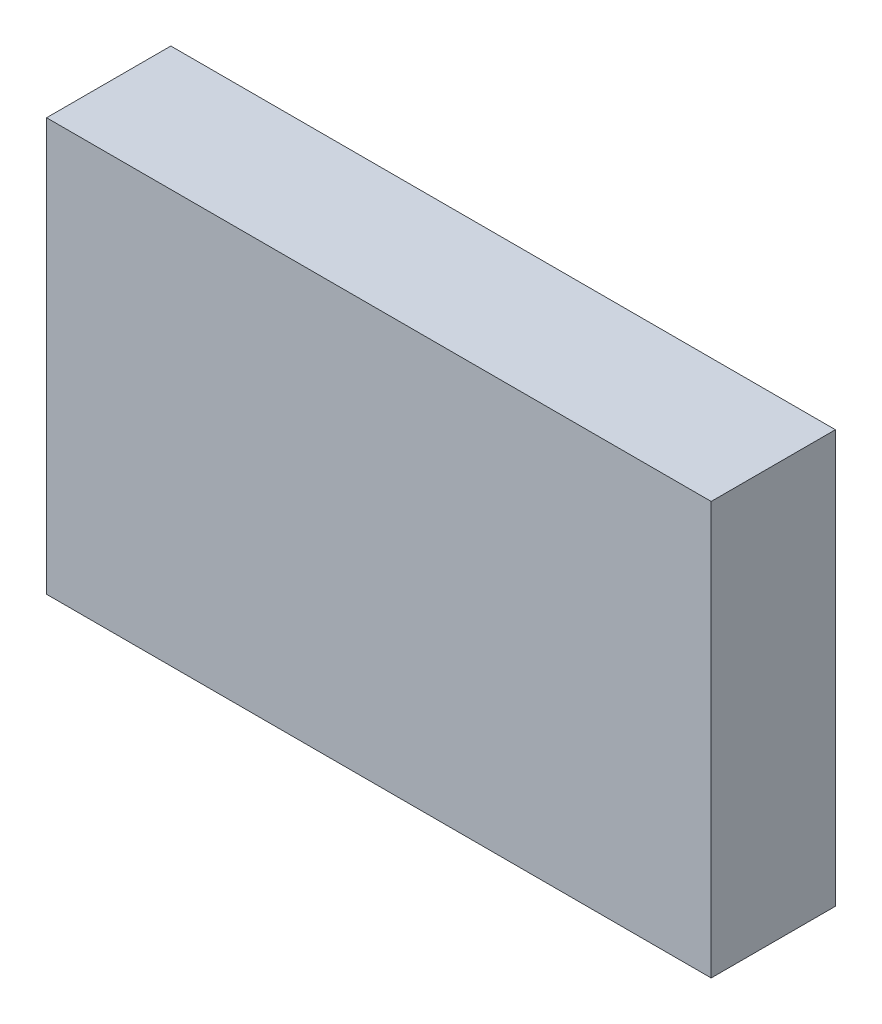
ISO-10303-21;
HEADER;
FILE_DESCRIPTION(('STEP AP214'),'2;1');
FILE_NAME('part.step','',(''),(''),'','','');
FILE_SCHEMA(('AUTOMOTIVE_DESIGN { 1 0 10303 214 1 1 1 1 }'));
ENDSEC;
DATA;
#1=APPLICATION_CONTEXT('core data for automotive mechanical design processes');
#2=APPLICATION_PROTOCOL_DEFINITION('international standard','automotive_design',2000,#1);
#3=PRODUCT_CONTEXT('',#1,'mechanical');
#4=PRODUCT('Part','Part','',(#3));
#5=PRODUCT_RELATED_PRODUCT_CATEGORY('part','',(#4));
#6=PRODUCT_DEFINITION_FORMATION('','',#4);
#7=PRODUCT_DEFINITION_CONTEXT('part definition',#1,'design');
#8=PRODUCT_DEFINITION('design','',#6,#7);
#9=PRODUCT_DEFINITION_SHAPE('','',#8);
#10=(LENGTH_UNIT() NAMED_UNIT(*) SI_UNIT(.MILLI.,.METRE.));
#11=(NAMED_UNIT(*) PLANE_ANGLE_UNIT() SI_UNIT($,.RADIAN.));
#12=(NAMED_UNIT(*) SI_UNIT($,.STERADIAN.) SOLID_ANGLE_UNIT());
#13=UNCERTAINTY_MEASURE_WITH_UNIT(LENGTH_MEASURE(1.E-05),#10,'distance_accuracy_value','');
#14=(GEOMETRIC_REPRESENTATION_CONTEXT(3) GLOBAL_UNCERTAINTY_ASSIGNED_CONTEXT((#13)) GLOBAL_UNIT_ASSIGNED_CONTEXT((#10,
#11,#12)) REPRESENTATION_CONTEXT('',''));
#15=CARTESIAN_POINT('',(0.,0.,0.));
#16=DIRECTION('',(0.,0.,1.));
#17=DIRECTION('',(1.,0.,0.));
#18=AXIS2_PLACEMENT_3D('',#15,#16,#17);
#19=CARTESIAN_POINT('',(0.,0.,0.));
#20=DIRECTION('',(-1.,0.,0.));
#21=DIRECTION('',(0.,0.,1.));
#22=AXIS2_PLACEMENT_3D('',#19,#20,#21);
#23=PLANE('',#22);
#24=DIRECTION('',(0.,0.,-1.));
#25=VECTOR('',#24,1.);
#26=CARTESIAN_POINT('',(0.,1489.71317371385,-186.935060191615));
#27=LINE('',#26,#25);
#28=CARTESIAN_POINT('',(0.,1489.71317371385,0.));
#29=VERTEX_POINT('',#28);
#30=CARTESIAN_POINT('',(0.,1489.71317371385,-186.935060191615));
#31=VERTEX_POINT('',#30);
#32=EDGE_CURVE('E77',#29,#31,#27,.T.);
#33=ORIENTED_EDGE('',*,*,#32,.F.);
#34=DIRECTION('',(0.,-1.,0.));
#35=VECTOR('',#34,1.);
#36=CARTESIAN_POINT('',(0.,1489.71317371385,0.));
#37=LINE('',#36,#35);
#38=CARTESIAN_POINT('',(0.,2110.71127200825,0.));
#39=VERTEX_POINT('',#38);
#40=EDGE_CURVE('E81',#39,#29,#37,.T.);
#41=ORIENTED_EDGE('',*,*,#40,.F.);
#42=DIRECTION('',(0.,0.,1.));
#43=VECTOR('',#42,1.);
#44=CARTESIAN_POINT('',(0.,2110.71127200825,0.));
#45=LINE('',#44,#43);
#46=CARTESIAN_POINT('',(0.,2110.71127200825,-186.935060191615));
#47=VERTEX_POINT('',#46);
#48=EDGE_CURVE('E84',#47,#39,#45,.T.);
#49=ORIENTED_EDGE('',*,*,#48,.F.);
#50=DIRECTION('',(0.,1.,0.));
#51=VECTOR('',#50,1.);
#52=CARTESIAN_POINT('',(0.,2110.71127200825,-186.935060191615));
#53=LINE('',#52,#51);
#54=EDGE_CURVE('E72',#31,#47,#53,.T.);
#55=ORIENTED_EDGE('',*,*,#54,.F.);
#56=EDGE_LOOP('',(#33,#41,#49,#55));
#57=FACE_BOUND('',#56,.T.);
#58=ADVANCED_FACE('F42',(#57),#23,.T.);
#59=CARTESIAN_POINT('',(1000.,0.,0.));
#60=DIRECTION('',(-1.,0.,0.));
#61=DIRECTION('',(0.,0.,1.));
#62=AXIS2_PLACEMENT_3D('',#59,#60,#61);
#63=PLANE('',#62);
#64=DIRECTION('',(0.,0.,-1.));
#65=VECTOR('',#64,1.);
#66=CARTESIAN_POINT('',(1000.,1489.71317371385,-186.935060191615));
#67=LINE('',#66,#65);
#68=CARTESIAN_POINT('',(1000.,1489.71317371385,0.));
#69=VERTEX_POINT('',#68);
#70=CARTESIAN_POINT('',(1000.,1489.71317371385,-186.935060191615));
#71=VERTEX_POINT('',#70);
#72=EDGE_CURVE('E55',#69,#71,#67,.T.);
#73=ORIENTED_EDGE('',*,*,#72,.T.);
#74=DIRECTION('',(0.,1.,0.));
#75=VECTOR('',#74,1.);
#76=CARTESIAN_POINT('',(1000.,2110.71127200825,-186.935060191615));
#77=LINE('',#76,#75);
#78=CARTESIAN_POINT('',(1000.,2110.71127200825,-186.935060191615));
#79=VERTEX_POINT('',#78);
#80=EDGE_CURVE('E12',#71,#79,#77,.T.);
#81=ORIENTED_EDGE('',*,*,#80,.T.);
#82=DIRECTION('',(0.,0.,1.));
#83=VECTOR('',#82,1.);
#84=CARTESIAN_POINT('',(1000.,2110.71127200825,0.));
#85=LINE('',#84,#83);
#86=CARTESIAN_POINT('',(1000.,2110.71127200825,0.));
#87=VERTEX_POINT('',#86);
#88=EDGE_CURVE('E98',#79,#87,#85,.T.);
#89=ORIENTED_EDGE('',*,*,#88,.T.);
#90=DIRECTION('',(0.,-1.,0.));
#91=VECTOR('',#90,1.);
#92=CARTESIAN_POINT('',(1000.,1489.71317371385,0.));
#93=LINE('',#92,#91);
#94=EDGE_CURVE('E61',#87,#69,#93,.T.);
#95=ORIENTED_EDGE('',*,*,#94,.T.);
#96=EDGE_LOOP('',(#73,#81,#89,#95));
#97=FACE_BOUND('',#96,.T.);
#98=ADVANCED_FACE('F123',(#97),#63,.F.);
#99=CARTESIAN_POINT('',(0.,2110.71127200825,0.));
#100=DIRECTION('',(0.,1.,0.));
#101=DIRECTION('',(0.,0.,1.));
#102=AXIS2_PLACEMENT_3D('',#99,#100,#101);
#103=PLANE('',#102);
#104=DIRECTION('',(1.,0.,0.));
#105=VECTOR('',#104,1.);
#106=CARTESIAN_POINT('',(0.,2110.71127200825,0.));
#107=LINE('',#106,#105);
#108=EDGE_CURVE('E100',#39,#87,#107,.T.);
#109=ORIENTED_EDGE('',*,*,#108,.T.);
#110=ORIENTED_EDGE('',*,*,#88,.F.);
#111=DIRECTION('',(1.,0.,0.));
#112=VECTOR('',#111,1.);
#113=CARTESIAN_POINT('',(0.,2110.71127200825,-186.935060191615));
#114=LINE('',#113,#112);
#115=EDGE_CURVE('E94',#47,#79,#114,.T.);
#116=ORIENTED_EDGE('',*,*,#115,.F.);
#117=ORIENTED_EDGE('',*,*,#48,.T.);
#118=EDGE_LOOP('',(#109,#110,#116,#117));
#119=FACE_BOUND('',#118,.T.);
#120=ADVANCED_FACE('F97',(#119),#103,.T.);
#121=CARTESIAN_POINT('',(0.,1489.71317371385,0.));
#122=DIRECTION('',(0.,0.,1.));
#123=DIRECTION('',(1.,0.,0.));
#124=AXIS2_PLACEMENT_3D('',#121,#122,#123);
#125=PLANE('',#124);
#126=DIRECTION('',(1.,0.,0.));
#127=VECTOR('',#126,1.);
#128=CARTESIAN_POINT('',(0.,1489.71317371385,0.));
#129=LINE('',#128,#127);
#130=EDGE_CURVE('E106',#29,#69,#129,.T.);
#131=ORIENTED_EDGE('',*,*,#130,.T.);
#132=ORIENTED_EDGE('',*,*,#94,.F.);
#133=ORIENTED_EDGE('',*,*,#108,.F.);
#134=ORIENTED_EDGE('',*,*,#40,.T.);
#135=EDGE_LOOP('',(#131,#132,#133,#134));
#136=FACE_BOUND('',#135,.T.);
#137=ADVANCED_FACE('F115',(#136),#125,.T.);
#138=CARTESIAN_POINT('',(0.,1489.71317371385,-186.935060191615));
#139=DIRECTION('',(0.,-1.,0.));
#140=DIRECTION('',(0.,0.,-1.));
#141=AXIS2_PLACEMENT_3D('',#138,#139,#140);
#142=PLANE('',#141);
#143=DIRECTION('',(1.,0.,0.));
#144=VECTOR('',#143,1.);
#145=CARTESIAN_POINT('',(0.,1489.71317371385,-186.935060191615));
#146=LINE('',#145,#144);
#147=EDGE_CURVE('E49',#31,#71,#146,.T.);
#148=ORIENTED_EDGE('',*,*,#147,.T.);
#149=ORIENTED_EDGE('',*,*,#72,.F.);
#150=ORIENTED_EDGE('',*,*,#130,.F.);
#151=ORIENTED_EDGE('',*,*,#32,.T.);
#152=EDGE_LOOP('',(#148,#149,#150,#151));
#153=FACE_BOUND('',#152,.T.);
#154=ADVANCED_FACE('F112',(#153),#142,.T.);
#155=CARTESIAN_POINT('',(0.,2110.71127200825,-186.935060191615));
#156=DIRECTION('',(0.,0.,-1.));
#157=DIRECTION('',(-1.,0.,0.));
#158=AXIS2_PLACEMENT_3D('',#155,#156,#157);
#159=PLANE('',#158);
#160=ORIENTED_EDGE('',*,*,#80,.F.);
#161=ORIENTED_EDGE('',*,*,#147,.F.);
#162=ORIENTED_EDGE('',*,*,#54,.T.);
#163=ORIENTED_EDGE('',*,*,#115,.T.);
#164=EDGE_LOOP('',(#160,#161,#162,#163));
#165=FACE_BOUND('',#164,.T.);
#166=ADVANCED_FACE('F93',(#165),#159,.T.);
#167=CLOSED_SHELL('',(#58,#98,#120,#137,#154,#166));
#168=MANIFOLD_SOLID_BREP('B2',#167);
#169=ADVANCED_BREP_SHAPE_REPRESENTATION('',(#18,#168),#14);
#170=SHAPE_DEFINITION_REPRESENTATION(#9,#169);
ENDSEC;
END-ISO-10303-21;
